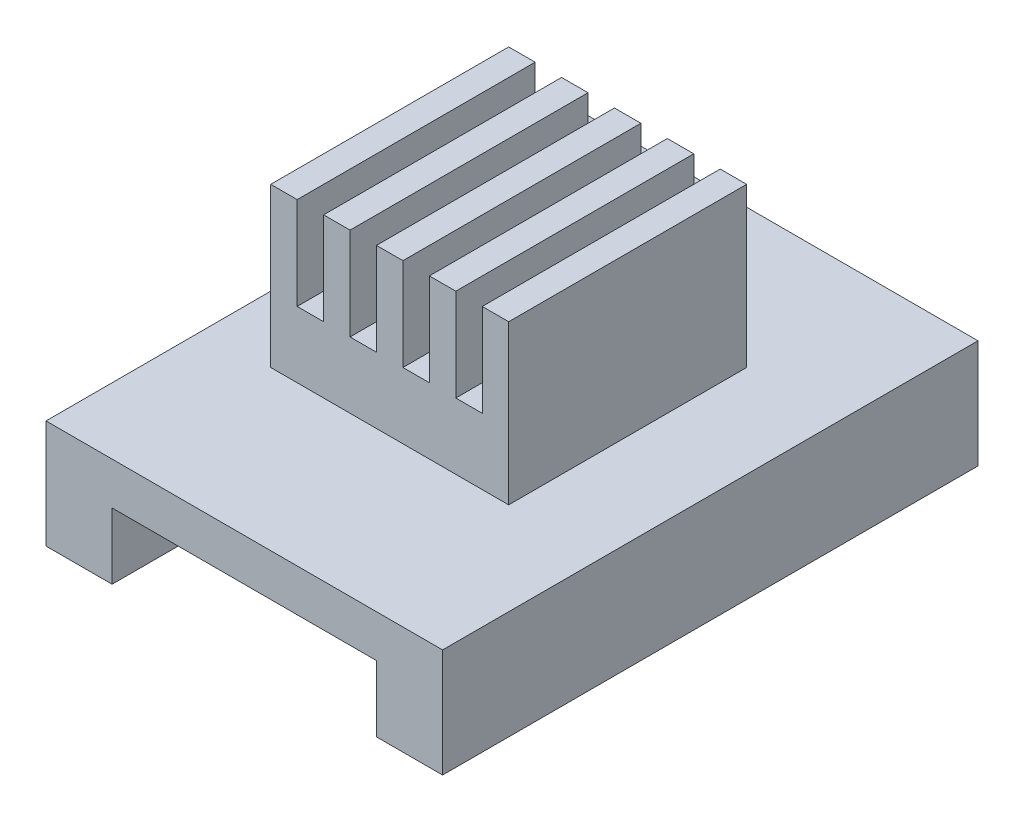
ISO-10303-21;
HEADER;
FILE_DESCRIPTION(('STEP AP214'),'2;1');
FILE_NAME('part.step','',(''),(''),'','','');
FILE_SCHEMA(('AUTOMOTIVE_DESIGN { 1 0 10303 214 1 1 1 1 }'));
ENDSEC;
DATA;
#1=APPLICATION_CONTEXT('core data for automotive mechanical design processes');
#2=APPLICATION_PROTOCOL_DEFINITION('international standard','automotive_design',2000,#1);
#3=PRODUCT_CONTEXT('',#1,'mechanical');
#4=PRODUCT('Part','Part','',(#3));
#5=PRODUCT_RELATED_PRODUCT_CATEGORY('part','',(#4));
#6=PRODUCT_DEFINITION_FORMATION('','',#4);
#7=PRODUCT_DEFINITION_CONTEXT('part definition',#1,'design');
#8=PRODUCT_DEFINITION('design','',#6,#7);
#9=PRODUCT_DEFINITION_SHAPE('','',#8);
#10=(LENGTH_UNIT() NAMED_UNIT(*) SI_UNIT(.MILLI.,.METRE.));
#11=(NAMED_UNIT(*) PLANE_ANGLE_UNIT() SI_UNIT($,.RADIAN.));
#12=(NAMED_UNIT(*) SI_UNIT($,.STERADIAN.) SOLID_ANGLE_UNIT());
#13=UNCERTAINTY_MEASURE_WITH_UNIT(LENGTH_MEASURE(1.E-05),#10,'distance_accuracy_value','');
#14=(GEOMETRIC_REPRESENTATION_CONTEXT(3) GLOBAL_UNCERTAINTY_ASSIGNED_CONTEXT((#13)) GLOBAL_UNIT_ASSIGNED_CONTEXT((#10,
#11,#12)) REPRESENTATION_CONTEXT('',''));
#15=CARTESIAN_POINT('',(0.,0.,0.));
#16=DIRECTION('',(0.,0.,1.));
#17=DIRECTION('',(1.,0.,0.));
#18=AXIS2_PLACEMENT_3D('',#15,#16,#17);
#19=CARTESIAN_POINT('',(0.,7.6,0.));
#20=DIRECTION('',(0.,-1.,0.));
#21=DIRECTION('',(0.,0.,-1.));
#22=AXIS2_PLACEMENT_3D('',#19,#20,#21);
#23=PLANE('',#22);
#24=DIRECTION('',(1.,0.,0.));
#25=VECTOR('',#24,1.);
#26=CARTESIAN_POINT('',(2.5,7.6,-6.));
#27=LINE('',#26,#25);
#28=CARTESIAN_POINT('',(2.5,7.6,-6.));
#29=VERTEX_POINT('',#28);
#30=CARTESIAN_POINT('',(3.5,7.6,-6.));
#31=VERTEX_POINT('',#30);
#32=EDGE_CURVE('E333',#29,#31,#27,.T.);
#33=ORIENTED_EDGE('',*,*,#32,.T.);
#34=DIRECTION('',(0.,0.,1.));
#35=VECTOR('',#34,1.);
#36=CARTESIAN_POINT('',(3.5,7.6,-20.251));
#37=LINE('',#36,#35);
#38=CARTESIAN_POINT('',(3.5,7.6,-15.));
#39=VERTEX_POINT('',#38);
#40=EDGE_CURVE('E238',#39,#31,#37,.T.);
#41=ORIENTED_EDGE('',*,*,#40,.F.);
#42=DIRECTION('',(-1.,0.,0.));
#43=VECTOR('',#42,1.);
#44=CARTESIAN_POINT('',(2.49999999999999,7.6,-15.));
#45=LINE('',#44,#43);
#46=CARTESIAN_POINT('',(2.49999999999999,7.6,-15.));
#47=VERTEX_POINT('',#46);
#48=EDGE_CURVE('E243',#39,#47,#45,.T.);
#49=ORIENTED_EDGE('',*,*,#48,.T.);
#50=DIRECTION('',(0.,0.,1.));
#51=VECTOR('',#50,1.);
#52=CARTESIAN_POINT('',(2.5,7.6,-6.));
#53=LINE('',#52,#51);
#54=EDGE_CURVE('E328',#47,#29,#53,.T.);
#55=ORIENTED_EDGE('',*,*,#54,.T.);
#56=EDGE_LOOP('',(#33,#41,#49,#55));
#57=FACE_BOUND('',#56,.T.);
#58=ADVANCED_FACE('F34',(#57),#23,.F.);
#59=CARTESIAN_POINT('',(5.5,7.6,-15.));
#60=VERTEX_POINT('',#59);
#61=CARTESIAN_POINT('',(4.5,7.6,-15.));
#62=VERTEX_POINT('',#61);
#63=EDGE_CURVE('E509',#60,#62,#45,.T.);
#64=ORIENTED_EDGE('',*,*,#63,.T.);
#65=DIRECTION('',(0.,0.,1.));
#66=VECTOR('',#65,1.);
#67=CARTESIAN_POINT('',(4.5,7.6,-20.251));
#68=LINE('',#67,#66);
#69=CARTESIAN_POINT('',(4.5,7.6,-6.));
#70=VERTEX_POINT('',#69);
#71=EDGE_CURVE('E254',#62,#70,#68,.T.);
#72=ORIENTED_EDGE('',*,*,#71,.T.);
#73=CARTESIAN_POINT('',(5.5,7.6,-6.));
#74=VERTEX_POINT('',#73);
#75=EDGE_CURVE('E337',#70,#74,#27,.T.);
#76=ORIENTED_EDGE('',*,*,#75,.T.);
#77=DIRECTION('',(0.,0.,1.));
#78=VECTOR('',#77,1.);
#79=CARTESIAN_POINT('',(5.5,7.6,-20.251));
#80=LINE('',#79,#78);
#81=EDGE_CURVE('E273',#60,#74,#80,.T.);
#82=ORIENTED_EDGE('',*,*,#81,.F.);
#83=EDGE_LOOP('',(#64,#72,#76,#82));
#84=FACE_BOUND('',#83,.T.);
#85=ADVANCED_FACE('F470',(#84),#23,.F.);
#86=CARTESIAN_POINT('',(7.5,7.6,-15.));
#87=VERTEX_POINT('',#86);
#88=CARTESIAN_POINT('',(6.5,7.6,-15.));
#89=VERTEX_POINT('',#88);
#90=EDGE_CURVE('E507',#87,#89,#45,.T.);
#91=ORIENTED_EDGE('',*,*,#90,.T.);
#92=DIRECTION('',(0.,0.,1.));
#93=VECTOR('',#92,1.);
#94=CARTESIAN_POINT('',(6.5,7.6,-20.251));
#95=LINE('',#94,#93);
#96=CARTESIAN_POINT('',(6.5,7.6,-6.));
#97=VERTEX_POINT('',#96);
#98=EDGE_CURVE('E275',#89,#97,#95,.T.);
#99=ORIENTED_EDGE('',*,*,#98,.T.);
#100=CARTESIAN_POINT('',(7.5,7.6,-6.));
#101=VERTEX_POINT('',#100);
#102=EDGE_CURVE('E527',#97,#101,#27,.T.);
#103=ORIENTED_EDGE('',*,*,#102,.T.);
#104=DIRECTION('',(0.,0.,1.));
#105=VECTOR('',#104,1.);
#106=CARTESIAN_POINT('',(7.5,7.6,-20.251));
#107=LINE('',#106,#105);
#108=EDGE_CURVE('E297',#87,#101,#107,.T.);
#109=ORIENTED_EDGE('',*,*,#108,.F.);
#110=EDGE_LOOP('',(#91,#99,#103,#109));
#111=FACE_BOUND('',#110,.T.);
#112=ADVANCED_FACE('F477',(#111),#23,.F.);
#113=CARTESIAN_POINT('',(9.49999999999999,7.6,-15.));
#114=VERTEX_POINT('',#113);
#115=CARTESIAN_POINT('',(8.49999999999999,7.6,-15.));
#116=VERTEX_POINT('',#115);
#117=EDGE_CURVE('E343',#114,#116,#45,.T.);
#118=ORIENTED_EDGE('',*,*,#117,.T.);
#119=DIRECTION('',(0.,0.,1.));
#120=VECTOR('',#119,1.);
#121=CARTESIAN_POINT('',(8.49999999999999,7.6,-20.251));
#122=LINE('',#121,#120);
#123=CARTESIAN_POINT('',(8.49999999999999,7.6,-6.));
#124=VERTEX_POINT('',#123);
#125=EDGE_CURVE('E299',#116,#124,#122,.T.);
#126=ORIENTED_EDGE('',*,*,#125,.T.);
#127=CARTESIAN_POINT('',(9.49999999999999,7.6,-6.));
#128=VERTEX_POINT('',#127);
#129=EDGE_CURVE('E529',#124,#128,#27,.T.);
#130=ORIENTED_EDGE('',*,*,#129,.T.);
#131=DIRECTION('',(0.,0.,1.));
#132=VECTOR('',#131,1.);
#133=CARTESIAN_POINT('',(9.49999999999999,7.6,-20.251));
#134=LINE('',#133,#132);
#135=EDGE_CURVE('E319',#114,#128,#134,.T.);
#136=ORIENTED_EDGE('',*,*,#135,.F.);
#137=EDGE_LOOP('',(#118,#126,#130,#136));
#138=FACE_BOUND('',#137,.T.);
#139=ADVANCED_FACE('F484',(#138),#23,.F.);
#140=CARTESIAN_POINT('',(0.,1.6,0.));
#141=DIRECTION('',(0.,-1.,0.));
#142=DIRECTION('',(0.,0.,-1.));
#143=AXIS2_PLACEMENT_3D('',#140,#141,#142);
#144=PLANE('',#143);
#145=DIRECTION('',(0.,0.,1.));
#146=VECTOR('',#145,1.);
#147=CARTESIAN_POINT('',(0.,1.6,0.));
#148=LINE('',#147,#146);
#149=CARTESIAN_POINT('',(0.,1.6,-20.25));
#150=VERTEX_POINT('',#149);
#151=CARTESIAN_POINT('',(0.,1.6,0.));
#152=VERTEX_POINT('',#151);
#153=EDGE_CURVE('E402',#150,#152,#148,.T.);
#154=ORIENTED_EDGE('',*,*,#153,.T.);
#155=DIRECTION('',(1.,0.,0.));
#156=VECTOR('',#155,1.);
#157=CARTESIAN_POINT('',(0.,1.6,0.));
#158=LINE('',#157,#156);
#159=CARTESIAN_POINT('',(15.,1.6,0.));
#160=VERTEX_POINT('',#159);
#161=EDGE_CURVE('E405',#152,#160,#158,.T.);
#162=ORIENTED_EDGE('',*,*,#161,.T.);
#163=DIRECTION('',(0.,0.,-1.));
#164=VECTOR('',#163,1.);
#165=CARTESIAN_POINT('',(15.,1.6,0.));
#166=LINE('',#165,#164);
#167=CARTESIAN_POINT('',(15.,1.6,-20.25));
#168=VERTEX_POINT('',#167);
#169=EDGE_CURVE('E408',#160,#168,#166,.T.);
#170=ORIENTED_EDGE('',*,*,#169,.T.);
#171=DIRECTION('',(-1.,0.,0.));
#172=VECTOR('',#171,1.);
#173=CARTESIAN_POINT('',(0.,1.6,-20.25));
#174=LINE('',#173,#172);
#175=EDGE_CURVE('E410',#168,#150,#174,.T.);
#176=ORIENTED_EDGE('',*,*,#175,.T.);
#177=EDGE_LOOP('',(#154,#162,#170,#176));
#178=FACE_BOUND('',#177,.T.);
#179=DIRECTION('',(0.,0.,1.));
#180=VECTOR('',#179,1.);
#181=CARTESIAN_POINT('',(2.5,1.6,-6.));
#182=LINE('',#181,#180);
#183=CARTESIAN_POINT('',(2.49999999999999,1.6,-15.));
#184=VERTEX_POINT('',#183);
#185=CARTESIAN_POINT('',(2.5,1.6,-6.));
#186=VERTEX_POINT('',#185);
#187=EDGE_CURVE('E237',#184,#186,#182,.T.);
#188=ORIENTED_EDGE('',*,*,#187,.F.);
#189=DIRECTION('',(-1.,0.,0.));
#190=VECTOR('',#189,1.);
#191=CARTESIAN_POINT('',(2.49999999999999,1.6,-15.));
#192=LINE('',#191,#190);
#193=CARTESIAN_POINT('',(11.5,1.6,-15.));
#194=VERTEX_POINT('',#193);
#195=EDGE_CURVE('E332',#194,#184,#192,.T.);
#196=ORIENTED_EDGE('',*,*,#195,.F.);
#197=DIRECTION('',(0.,0.,-1.));
#198=VECTOR('',#197,1.);
#199=CARTESIAN_POINT('',(11.5,1.6,-6.));
#200=LINE('',#199,#198);
#201=CARTESIAN_POINT('',(11.5,1.6,-6.));
#202=VERTEX_POINT('',#201);
#203=EDGE_CURVE('E349',#202,#194,#200,.T.);
#204=ORIENTED_EDGE('',*,*,#203,.F.);
#205=DIRECTION('',(1.,0.,0.));
#206=VECTOR('',#205,1.);
#207=CARTESIAN_POINT('',(2.5,1.6,-6.));
#208=LINE('',#207,#206);
#209=EDGE_CURVE('E346',#186,#202,#208,.T.);
#210=ORIENTED_EDGE('',*,*,#209,.F.);
#211=EDGE_LOOP('',(#188,#196,#204,#210));
#212=FACE_BOUND('',#211,.T.);
#213=ADVANCED_FACE('F440',(#178,#212),#144,.F.);
#214=CARTESIAN_POINT('',(0.,0.,0.));
#215=DIRECTION('',(0.,-1.,0.));
#216=DIRECTION('',(0.,0.,-1.));
#217=AXIS2_PLACEMENT_3D('',#214,#215,#216);
#218=PLANE('',#217);
#219=DIRECTION('',(-1.,0.,0.));
#220=VECTOR('',#219,1.);
#221=CARTESIAN_POINT('',(0.,0.,-20.25));
#222=LINE('',#221,#220);
#223=CARTESIAN_POINT('',(12.5,0.,-20.25));
#224=VERTEX_POINT('',#223);
#225=CARTESIAN_POINT('',(2.5,0.,-20.25));
#226=VERTEX_POINT('',#225);
#227=EDGE_CURVE('E406',#224,#226,#222,.T.);
#228=ORIENTED_EDGE('',*,*,#227,.F.);
#229=DIRECTION('',(0.,0.,-1.));
#230=VECTOR('',#229,1.);
#231=CARTESIAN_POINT('',(12.5,0.,0.));
#232=LINE('',#231,#230);
#233=CARTESIAN_POINT('',(12.5,0.,0.));
#234=VERTEX_POINT('',#233);
#235=EDGE_CURVE('E365',#234,#224,#232,.T.);
#236=ORIENTED_EDGE('',*,*,#235,.F.);
#237=DIRECTION('',(1.,0.,0.));
#238=VECTOR('',#237,1.);
#239=CARTESIAN_POINT('',(0.,0.,0.));
#240=LINE('',#239,#238);
#241=CARTESIAN_POINT('',(2.5,0.,0.));
#242=VERTEX_POINT('',#241);
#243=EDGE_CURVE('E401',#242,#234,#240,.T.);
#244=ORIENTED_EDGE('',*,*,#243,.F.);
#245=DIRECTION('',(0.,0.,1.));
#246=VECTOR('',#245,1.);
#247=CARTESIAN_POINT('',(2.5,0.,0.));
#248=LINE('',#247,#246);
#249=EDGE_CURVE('E382',#226,#242,#248,.T.);
#250=ORIENTED_EDGE('',*,*,#249,.F.);
#251=EDGE_LOOP('',(#228,#236,#244,#250));
#252=FACE_BOUND('',#251,.T.);
#253=ADVANCED_FACE('F457',(#252),#218,.T.);
#254=CARTESIAN_POINT('',(0.,1.6,0.));
#255=DIRECTION('',(1.,0.,0.));
#256=DIRECTION('',(0.,0.,-1.));
#257=AXIS2_PLACEMENT_3D('',#254,#255,#256);
#258=PLANE('',#257);
#259=DIRECTION('',(0.,-1.,0.));
#260=VECTOR('',#259,1.);
#261=CARTESIAN_POINT('',(0.,1.6,-20.25));
#262=LINE('',#261,#260);
#263=CARTESIAN_POINT('',(0.,-2.5,-20.25));
#264=VERTEX_POINT('',#263);
#265=EDGE_CURVE('E412',#150,#264,#262,.T.);
#266=ORIENTED_EDGE('',*,*,#265,.T.);
#267=DIRECTION('',(0.,0.,-1.));
#268=VECTOR('',#267,1.);
#269=CARTESIAN_POINT('',(0.,-2.5,0.));
#270=LINE('',#269,#268);
#271=CARTESIAN_POINT('',(0.,-2.5,0.));
#272=VERTEX_POINT('',#271);
#273=EDGE_CURVE('E383',#272,#264,#270,.T.);
#274=ORIENTED_EDGE('',*,*,#273,.F.);
#275=DIRECTION('',(0.,-1.,0.));
#276=VECTOR('',#275,1.);
#277=CARTESIAN_POINT('',(0.,1.6,0.));
#278=LINE('',#277,#276);
#279=EDGE_CURVE('E11',#152,#272,#278,.T.);
#280=ORIENTED_EDGE('',*,*,#279,.F.);
#281=ORIENTED_EDGE('',*,*,#153,.F.);
#282=EDGE_LOOP('',(#266,#274,#280,#281));
#283=FACE_BOUND('',#282,.T.);
#284=ADVANCED_FACE('F36',(#283),#258,.F.);
#285=CARTESIAN_POINT('',(0.,1.6,0.));
#286=DIRECTION('',(0.,0.,-1.));
#287=DIRECTION('',(-1.,0.,0.));
#288=AXIS2_PLACEMENT_3D('',#285,#286,#287);
#289=PLANE('',#288);
#290=ORIENTED_EDGE('',*,*,#279,.T.);
#291=DIRECTION('',(-1.,0.,0.));
#292=VECTOR('',#291,1.);
#293=CARTESIAN_POINT('',(0.,-2.5,0.));
#294=LINE('',#293,#292);
#295=CARTESIAN_POINT('',(2.5,-2.5,0.));
#296=VERTEX_POINT('',#295);
#297=EDGE_CURVE('E390',#296,#272,#294,.T.);
#298=ORIENTED_EDGE('',*,*,#297,.F.);
#299=DIRECTION('',(0.,1.,0.));
#300=VECTOR('',#299,1.);
#301=CARTESIAN_POINT('',(2.5,-2.5,0.));
#302=LINE('',#301,#300);
#303=EDGE_CURVE('E393',#296,#242,#302,.T.);
#304=ORIENTED_EDGE('',*,*,#303,.T.);
#305=ORIENTED_EDGE('',*,*,#243,.T.);
#306=DIRECTION('',(0.,1.,0.));
#307=VECTOR('',#306,1.);
#308=CARTESIAN_POINT('',(12.5,-2.5,0.));
#309=LINE('',#308,#307);
#310=CARTESIAN_POINT('',(12.5,-2.5,0.));
#311=VERTEX_POINT('',#310);
#312=EDGE_CURVE('E380',#311,#234,#309,.T.);
#313=ORIENTED_EDGE('',*,*,#312,.F.);
#314=DIRECTION('',(-1.,0.,0.));
#315=VECTOR('',#314,1.);
#316=CARTESIAN_POINT('',(15.,-2.5,0.));
#317=LINE('',#316,#315);
#318=CARTESIAN_POINT('',(15.,-2.5,0.));
#319=VERTEX_POINT('',#318);
#320=EDGE_CURVE('E369',#319,#311,#317,.T.);
#321=ORIENTED_EDGE('',*,*,#320,.F.);
#322=DIRECTION('',(0.,-1.,0.));
#323=VECTOR('',#322,1.);
#324=CARTESIAN_POINT('',(15.,1.6,0.));
#325=LINE('',#324,#323);
#326=EDGE_CURVE('E42',#160,#319,#325,.T.);
#327=ORIENTED_EDGE('',*,*,#326,.F.);
#328=ORIENTED_EDGE('',*,*,#161,.F.);
#329=EDGE_LOOP('',(#290,#298,#304,#305,#313,#321,#327,#328));
#330=FACE_BOUND('',#329,.T.);
#331=ADVANCED_FACE('F427',(#330),#289,.F.);
#332=CARTESIAN_POINT('',(15.,1.6,0.));
#333=DIRECTION('',(-1.,0.,0.));
#334=DIRECTION('',(0.,0.,1.));
#335=AXIS2_PLACEMENT_3D('',#332,#333,#334);
#336=PLANE('',#335);
#337=ORIENTED_EDGE('',*,*,#326,.T.);
#338=DIRECTION('',(0.,0.,1.));
#339=VECTOR('',#338,1.);
#340=CARTESIAN_POINT('',(15.,-2.5,0.));
#341=LINE('',#340,#339);
#342=CARTESIAN_POINT('',(15.,-2.5,-20.25));
#343=VERTEX_POINT('',#342);
#344=EDGE_CURVE('E366',#343,#319,#341,.T.);
#345=ORIENTED_EDGE('',*,*,#344,.F.);
#346=DIRECTION('',(0.,-1.,0.));
#347=VECTOR('',#346,1.);
#348=CARTESIAN_POINT('',(15.,1.6,-20.25));
#349=LINE('',#348,#347);
#350=EDGE_CURVE('E417',#168,#343,#349,.T.);
#351=ORIENTED_EDGE('',*,*,#350,.F.);
#352=ORIENTED_EDGE('',*,*,#169,.F.);
#353=EDGE_LOOP('',(#337,#345,#351,#352));
#354=FACE_BOUND('',#353,.T.);
#355=ADVANCED_FACE('F423',(#354),#336,.F.);
#356=CARTESIAN_POINT('',(0.,1.6,-20.25));
#357=DIRECTION('',(0.,0.,1.));
#358=DIRECTION('',(1.,0.,0.));
#359=AXIS2_PLACEMENT_3D('',#356,#357,#358);
#360=PLANE('',#359);
#361=ORIENTED_EDGE('',*,*,#350,.T.);
#362=DIRECTION('',(1.,0.,0.));
#363=VECTOR('',#362,1.);
#364=CARTESIAN_POINT('',(15.,-2.5,-20.25));
#365=LINE('',#364,#363);
#366=CARTESIAN_POINT('',(12.5,-2.5,-20.25));
#367=VERTEX_POINT('',#366);
#368=EDGE_CURVE('E373',#367,#343,#365,.T.);
#369=ORIENTED_EDGE('',*,*,#368,.F.);
#370=DIRECTION('',(0.,1.,0.));
#371=VECTOR('',#370,1.);
#372=CARTESIAN_POINT('',(12.5,-2.5,-20.25));
#373=LINE('',#372,#371);
#374=EDGE_CURVE('E376',#367,#224,#373,.T.);
#375=ORIENTED_EDGE('',*,*,#374,.T.);
#376=ORIENTED_EDGE('',*,*,#227,.T.);
#377=DIRECTION('',(0.,1.,0.));
#378=VECTOR('',#377,1.);
#379=CARTESIAN_POINT('',(2.5,-2.5,-20.25));
#380=LINE('',#379,#378);
#381=CARTESIAN_POINT('',(2.5,-2.5,-20.25));
#382=VERTEX_POINT('',#381);
#383=EDGE_CURVE('E398',#382,#226,#380,.T.);
#384=ORIENTED_EDGE('',*,*,#383,.F.);
#385=DIRECTION('',(1.,0.,0.));
#386=VECTOR('',#385,1.);
#387=CARTESIAN_POINT('',(0.,-2.5,-20.25));
#388=LINE('',#387,#386);
#389=EDGE_CURVE('E386',#264,#382,#388,.T.);
#390=ORIENTED_EDGE('',*,*,#389,.F.);
#391=ORIENTED_EDGE('',*,*,#265,.F.);
#392=ORIENTED_EDGE('',*,*,#175,.F.);
#393=EDGE_LOOP('',(#361,#369,#375,#376,#384,#390,#391,#392));
#394=FACE_BOUND('',#393,.T.);
#395=ADVANCED_FACE('F434',(#394),#360,.F.);
#396=CARTESIAN_POINT('',(2.5,-2.5,0.));
#397=DIRECTION('',(-1.,0.,0.));
#398=DIRECTION('',(0.,0.,1.));
#399=AXIS2_PLACEMENT_3D('',#396,#397,#398);
#400=PLANE('',#399);
#401=ORIENTED_EDGE('',*,*,#249,.T.);
#402=ORIENTED_EDGE('',*,*,#303,.F.);
#403=DIRECTION('',(0.,0.,1.));
#404=VECTOR('',#403,1.);
#405=CARTESIAN_POINT('',(2.5,-2.5,0.));
#406=LINE('',#405,#404);
#407=EDGE_CURVE('E388',#382,#296,#406,.T.);
#408=ORIENTED_EDGE('',*,*,#407,.F.);
#409=ORIENTED_EDGE('',*,*,#383,.T.);
#410=EDGE_LOOP('',(#401,#402,#408,#409));
#411=FACE_BOUND('',#410,.T.);
#412=ADVANCED_FACE('F454',(#411),#400,.F.);
#413=CARTESIAN_POINT('',(0.,-2.5,0.));
#414=DIRECTION('',(0.,-1.,0.));
#415=DIRECTION('',(0.,0.,-1.));
#416=AXIS2_PLACEMENT_3D('',#413,#414,#415);
#417=PLANE('',#416);
#418=ORIENTED_EDGE('',*,*,#273,.T.);
#419=ORIENTED_EDGE('',*,*,#389,.T.);
#420=ORIENTED_EDGE('',*,*,#407,.T.);
#421=ORIENTED_EDGE('',*,*,#297,.T.);
#422=EDGE_LOOP('',(#418,#419,#420,#421));
#423=FACE_BOUND('',#422,.T.);
#424=ADVANCED_FACE('F447',(#423),#417,.T.);
#425=CARTESIAN_POINT('',(12.5,-2.5,0.));
#426=DIRECTION('',(1.,0.,0.));
#427=DIRECTION('',(0.,0.,-1.));
#428=AXIS2_PLACEMENT_3D('',#425,#426,#427);
#429=PLANE('',#428);
#430=ORIENTED_EDGE('',*,*,#235,.T.);
#431=ORIENTED_EDGE('',*,*,#374,.F.);
#432=DIRECTION('',(0.,0.,-1.));
#433=VECTOR('',#432,1.);
#434=CARTESIAN_POINT('',(12.5,-2.5,0.));
#435=LINE('',#434,#433);
#436=EDGE_CURVE('E371',#311,#367,#435,.T.);
#437=ORIENTED_EDGE('',*,*,#436,.F.);
#438=ORIENTED_EDGE('',*,*,#312,.T.);
#439=EDGE_LOOP('',(#430,#431,#437,#438));
#440=FACE_BOUND('',#439,.T.);
#441=ADVANCED_FACE('F459',(#440),#429,.F.);
#442=CARTESIAN_POINT('',(0.,-2.5,0.));
#443=DIRECTION('',(0.,1.,0.));
#444=DIRECTION('',(0.,0.,1.));
#445=AXIS2_PLACEMENT_3D('',#442,#443,#444);
#446=PLANE('',#445);
#447=ORIENTED_EDGE('',*,*,#344,.T.);
#448=ORIENTED_EDGE('',*,*,#320,.T.);
#449=ORIENTED_EDGE('',*,*,#436,.T.);
#450=ORIENTED_EDGE('',*,*,#368,.T.);
#451=EDGE_LOOP('',(#447,#448,#449,#450));
#452=FACE_BOUND('',#451,.T.);
#453=ADVANCED_FACE('F430',(#452),#446,.F.);
#454=CARTESIAN_POINT('',(2.5,7.6,-6.));
#455=DIRECTION('',(1.,0.,0.));
#456=DIRECTION('',(0.,0.,-1.));
#457=AXIS2_PLACEMENT_3D('',#454,#455,#456);
#458=PLANE('',#457);
#459=ORIENTED_EDGE('',*,*,#187,.T.);
#460=DIRECTION('',(0.,-1.,0.));
#461=VECTOR('',#460,1.);
#462=CARTESIAN_POINT('',(2.5,7.6,-6.));
#463=LINE('',#462,#461);
#464=EDGE_CURVE('E362',#29,#186,#463,.T.);
#465=ORIENTED_EDGE('',*,*,#464,.F.);
#466=ORIENTED_EDGE('',*,*,#54,.F.);
#467=DIRECTION('',(0.,-1.,0.));
#468=VECTOR('',#467,1.);
#469=CARTESIAN_POINT('',(2.49999999999999,7.6,-15.));
#470=LINE('',#469,#468);
#471=EDGE_CURVE('E342',#47,#184,#470,.T.);
#472=ORIENTED_EDGE('',*,*,#471,.T.);
#473=EDGE_LOOP('',(#459,#465,#466,#472));
#474=FACE_BOUND('',#473,.T.);
#475=ADVANCED_FACE('F466',(#474),#458,.F.);
#476=CARTESIAN_POINT('',(2.5,7.6,-6.));
#477=DIRECTION('',(0.,0.,-1.));
#478=DIRECTION('',(-1.,0.,0.));
#479=AXIS2_PLACEMENT_3D('',#476,#477,#478);
#480=PLANE('',#479);
#481=DIRECTION('',(1.,0.,0.));
#482=VECTOR('',#481,1.);
#483=CARTESIAN_POINT('',(3.5,4.1,-6.));
#484=LINE('',#483,#482);
#485=CARTESIAN_POINT('',(3.5,4.1,-6.));
#486=VERTEX_POINT('',#485);
#487=CARTESIAN_POINT('',(4.5,4.1,-6.));
#488=VERTEX_POINT('',#487);
#489=EDGE_CURVE('E246',#486,#488,#484,.T.);
#490=ORIENTED_EDGE('',*,*,#489,.F.);
#491=DIRECTION('',(0.,-1.,0.));
#492=VECTOR('',#491,1.);
#493=CARTESIAN_POINT('',(3.5,7.6,-6.));
#494=LINE('',#493,#492);
#495=EDGE_CURVE('E224',#31,#486,#494,.T.);
#496=ORIENTED_EDGE('',*,*,#495,.F.);
#497=ORIENTED_EDGE('',*,*,#32,.F.);
#498=ORIENTED_EDGE('',*,*,#464,.T.);
#499=ORIENTED_EDGE('',*,*,#209,.T.);
#500=DIRECTION('',(0.,-1.,0.));
#501=VECTOR('',#500,1.);
#502=CARTESIAN_POINT('',(11.5,7.6,-6.));
#503=LINE('',#502,#501);
#504=CARTESIAN_POINT('',(11.5,7.6,-6.));
#505=VERTEX_POINT('',#504);
#506=EDGE_CURVE('E359',#505,#202,#503,.T.);
#507=ORIENTED_EDGE('',*,*,#506,.F.);
#508=CARTESIAN_POINT('',(10.5,7.6,-6.));
#509=VERTEX_POINT('',#508);
#510=EDGE_CURVE('E331',#509,#505,#27,.T.);
#511=ORIENTED_EDGE('',*,*,#510,.F.);
#512=DIRECTION('',(0.,1.,0.));
#513=VECTOR('',#512,1.);
#514=CARTESIAN_POINT('',(10.5,7.6,-6.));
#515=LINE('',#514,#513);
#516=CARTESIAN_POINT('',(10.5,4.1,-6.));
#517=VERTEX_POINT('',#516);
#518=EDGE_CURVE('E49',#517,#509,#515,.T.);
#519=ORIENTED_EDGE('',*,*,#518,.F.);
#520=DIRECTION('',(1.,0.,0.));
#521=VECTOR('',#520,1.);
#522=CARTESIAN_POINT('',(9.49999999999999,4.1,-6.));
#523=LINE('',#522,#521);
#524=CARTESIAN_POINT('',(9.49999999999999,4.1,-6.));
#525=VERTEX_POINT('',#524);
#526=EDGE_CURVE('E314',#525,#517,#523,.T.);
#527=ORIENTED_EDGE('',*,*,#526,.F.);
#528=DIRECTION('',(0.,-1.,0.));
#529=VECTOR('',#528,1.);
#530=CARTESIAN_POINT('',(9.49999999999999,7.6,-6.));
#531=LINE('',#530,#529);
#532=EDGE_CURVE('E311',#128,#525,#531,.T.);
#533=ORIENTED_EDGE('',*,*,#532,.F.);
#534=ORIENTED_EDGE('',*,*,#129,.F.);
#535=DIRECTION('',(0.,1.,0.));
#536=VECTOR('',#535,1.);
#537=CARTESIAN_POINT('',(8.49999999999999,7.6,-6.));
#538=LINE('',#537,#536);
#539=CARTESIAN_POINT('',(8.49999999999999,4.1,-6.));
#540=VERTEX_POINT('',#539);
#541=EDGE_CURVE('E57',#540,#124,#538,.T.);
#542=ORIENTED_EDGE('',*,*,#541,.F.);
#543=DIRECTION('',(1.,0.,0.));
#544=VECTOR('',#543,1.);
#545=CARTESIAN_POINT('',(7.5,4.1,-6.));
#546=LINE('',#545,#544);
#547=CARTESIAN_POINT('',(7.5,4.1,-6.));
#548=VERTEX_POINT('',#547);
#549=EDGE_CURVE('E292',#548,#540,#546,.T.);
#550=ORIENTED_EDGE('',*,*,#549,.F.);
#551=DIRECTION('',(0.,-1.,0.));
#552=VECTOR('',#551,1.);
#553=CARTESIAN_POINT('',(7.5,7.6,-6.));
#554=LINE('',#553,#552);
#555=EDGE_CURVE('E289',#101,#548,#554,.T.);
#556=ORIENTED_EDGE('',*,*,#555,.F.);
#557=ORIENTED_EDGE('',*,*,#102,.F.);
#558=DIRECTION('',(0.,1.,0.));
#559=VECTOR('',#558,1.);
#560=CARTESIAN_POINT('',(6.5,7.6,-6.));
#561=LINE('',#560,#559);
#562=CARTESIAN_POINT('',(6.5,4.1,-6.));
#563=VERTEX_POINT('',#562);
#564=EDGE_CURVE('E270',#563,#97,#561,.T.);
#565=ORIENTED_EDGE('',*,*,#564,.F.);
#566=DIRECTION('',(1.,0.,0.));
#567=VECTOR('',#566,1.);
#568=CARTESIAN_POINT('',(5.5,4.1,-6.));
#569=LINE('',#568,#567);
#570=CARTESIAN_POINT('',(5.5,4.1,-6.));
#571=VERTEX_POINT('',#570);
#572=EDGE_CURVE('E267',#571,#563,#569,.T.);
#573=ORIENTED_EDGE('',*,*,#572,.F.);
#574=DIRECTION('',(0.,-1.,0.));
#575=VECTOR('',#574,1.);
#576=CARTESIAN_POINT('',(5.5,7.6,-6.));
#577=LINE('',#576,#575);
#578=EDGE_CURVE('E264',#74,#571,#577,.T.);
#579=ORIENTED_EDGE('',*,*,#578,.F.);
#580=ORIENTED_EDGE('',*,*,#75,.F.);
#581=DIRECTION('',(0.,1.,0.));
#582=VECTOR('',#581,1.);
#583=CARTESIAN_POINT('',(4.5,7.6,-6.));
#584=LINE('',#583,#582);
#585=EDGE_CURVE('E229',#488,#70,#584,.T.);
#586=ORIENTED_EDGE('',*,*,#585,.F.);
#587=EDGE_LOOP('',(#490,#496,#497,#498,#499,#507,#511,#519,#527,#533,#534,#542,#550,#556,#557,
#565,#573,#579,#580,#586));
#588=FACE_BOUND('',#587,.T.);
#589=ADVANCED_FACE('F519',(#588),#480,.F.);
#590=CARTESIAN_POINT('',(11.5,7.6,-6.));
#591=DIRECTION('',(-1.,0.,0.));
#592=DIRECTION('',(0.,0.,1.));
#593=AXIS2_PLACEMENT_3D('',#590,#591,#592);
#594=PLANE('',#593);
#595=ORIENTED_EDGE('',*,*,#203,.T.);
#596=DIRECTION('',(0.,-1.,0.));
#597=VECTOR('',#596,1.);
#598=CARTESIAN_POINT('',(11.5,7.6,-15.));
#599=LINE('',#598,#597);
#600=CARTESIAN_POINT('',(11.5,7.6,-15.));
#601=VERTEX_POINT('',#600);
#602=EDGE_CURVE('E356',#601,#194,#599,.T.);
#603=ORIENTED_EDGE('',*,*,#602,.F.);
#604=DIRECTION('',(0.,0.,-1.));
#605=VECTOR('',#604,1.);
#606=CARTESIAN_POINT('',(11.5,7.6,-6.));
#607=LINE('',#606,#605);
#608=EDGE_CURVE('E336',#505,#601,#607,.T.);
#609=ORIENTED_EDGE('',*,*,#608,.F.);
#610=ORIENTED_EDGE('',*,*,#506,.T.);
#611=EDGE_LOOP('',(#595,#603,#609,#610));
#612=FACE_BOUND('',#611,.T.);
#613=ADVANCED_FACE('F491',(#612),#594,.F.);
#614=CARTESIAN_POINT('',(2.49999999999999,7.6,-15.));
#615=DIRECTION('',(0.,0.,1.));
#616=DIRECTION('',(1.,0.,0.));
#617=AXIS2_PLACEMENT_3D('',#614,#615,#616);
#618=PLANE('',#617);
#619=ORIENTED_EDGE('',*,*,#48,.F.);
#620=DIRECTION('',(0.,1.,0.));
#621=VECTOR('',#620,1.);
#622=CARTESIAN_POINT('',(3.5,7.6,-15.));
#623=LINE('',#622,#621);
#624=CARTESIAN_POINT('',(3.5,4.1,-15.));
#625=VERTEX_POINT('',#624);
#626=EDGE_CURVE('E221',#625,#39,#623,.T.);
#627=ORIENTED_EDGE('',*,*,#626,.F.);
#628=DIRECTION('',(-1.,0.,0.));
#629=VECTOR('',#628,1.);
#630=CARTESIAN_POINT('',(3.5,4.1,-15.));
#631=LINE('',#630,#629);
#632=CARTESIAN_POINT('',(4.5,4.1,-15.));
#633=VERTEX_POINT('',#632);
#634=EDGE_CURVE('E232',#633,#625,#631,.T.);
#635=ORIENTED_EDGE('',*,*,#634,.F.);
#636=DIRECTION('',(0.,-1.,0.));
#637=VECTOR('',#636,1.);
#638=CARTESIAN_POINT('',(4.5,7.6,-15.));
#639=LINE('',#638,#637);
#640=EDGE_CURVE('E244',#62,#633,#639,.T.);
#641=ORIENTED_EDGE('',*,*,#640,.F.);
#642=ORIENTED_EDGE('',*,*,#63,.F.);
#643=DIRECTION('',(0.,1.,0.));
#644=VECTOR('',#643,1.);
#645=CARTESIAN_POINT('',(5.5,7.6,-15.));
#646=LINE('',#645,#644);
#647=CARTESIAN_POINT('',(5.5,4.1,-15.));
#648=VERTEX_POINT('',#647);
#649=EDGE_CURVE('E261',#648,#60,#646,.T.);
#650=ORIENTED_EDGE('',*,*,#649,.F.);
#651=DIRECTION('',(-1.,0.,0.));
#652=VECTOR('',#651,1.);
#653=CARTESIAN_POINT('',(5.5,4.1,-15.));
#654=LINE('',#653,#652);
#655=CARTESIAN_POINT('',(6.5,4.1,-15.));
#656=VERTEX_POINT('',#655);
#657=EDGE_CURVE('E248',#656,#648,#654,.T.);
#658=ORIENTED_EDGE('',*,*,#657,.F.);
#659=DIRECTION('',(0.,-1.,0.));
#660=VECTOR('',#659,1.);
#661=CARTESIAN_POINT('',(6.5,7.6,-15.));
#662=LINE('',#661,#660);
#663=EDGE_CURVE('E258',#89,#656,#662,.T.);
#664=ORIENTED_EDGE('',*,*,#663,.F.);
#665=ORIENTED_EDGE('',*,*,#90,.F.);
#666=DIRECTION('',(0.,1.,0.));
#667=VECTOR('',#666,1.);
#668=CARTESIAN_POINT('',(7.5,7.6,-15.));
#669=LINE('',#668,#667);
#670=CARTESIAN_POINT('',(7.5,4.1,-15.));
#671=VERTEX_POINT('',#670);
#672=EDGE_CURVE('E286',#671,#87,#669,.T.);
#673=ORIENTED_EDGE('',*,*,#672,.F.);
#674=DIRECTION('',(-1.,0.,0.));
#675=VECTOR('',#674,1.);
#676=CARTESIAN_POINT('',(7.5,4.1,-15.));
#677=LINE('',#676,#675);
#678=CARTESIAN_POINT('',(8.49999999999999,4.1,-15.));
#679=VERTEX_POINT('',#678);
#680=EDGE_CURVE('E262',#679,#671,#677,.T.);
#681=ORIENTED_EDGE('',*,*,#680,.F.);
#682=DIRECTION('',(0.,-1.,0.));
#683=VECTOR('',#682,1.);
#684=CARTESIAN_POINT('',(8.49999999999999,7.6,-15.));
#685=LINE('',#684,#683);
#686=EDGE_CURVE('E283',#116,#679,#685,.T.);
#687=ORIENTED_EDGE('',*,*,#686,.F.);
#688=ORIENTED_EDGE('',*,*,#117,.F.);
#689=DIRECTION('',(0.,1.,0.));
#690=VECTOR('',#689,1.);
#691=CARTESIAN_POINT('',(9.49999999999999,7.6,-15.));
#692=LINE('',#691,#690);
#693=CARTESIAN_POINT('',(9.49999999999999,4.1,-15.));
#694=VERTEX_POINT('',#693);
#695=EDGE_CURVE('E309',#694,#114,#692,.T.);
#696=ORIENTED_EDGE('',*,*,#695,.F.);
#697=DIRECTION('',(-1.,0.,0.));
#698=VECTOR('',#697,1.);
#699=CARTESIAN_POINT('',(9.49999999999999,4.1,-15.));
#700=LINE('',#699,#698);
#701=CARTESIAN_POINT('',(10.5,4.1,-15.));
#702=VERTEX_POINT('',#701);
#703=EDGE_CURVE('E287',#702,#694,#700,.T.);
#704=ORIENTED_EDGE('',*,*,#703,.F.);
#705=DIRECTION('',(0.,-1.,0.));
#706=VECTOR('',#705,1.);
#707=CARTESIAN_POINT('',(10.5,7.6,-15.));
#708=LINE('',#707,#706);
#709=CARTESIAN_POINT('',(10.5,7.6,-15.));
#710=VERTEX_POINT('',#709);
#711=EDGE_CURVE('E306',#710,#702,#708,.T.);
#712=ORIENTED_EDGE('',*,*,#711,.F.);
#713=EDGE_CURVE('E339',#601,#710,#45,.T.);
#714=ORIENTED_EDGE('',*,*,#713,.F.);
#715=ORIENTED_EDGE('',*,*,#602,.T.);
#716=ORIENTED_EDGE('',*,*,#195,.T.);
#717=ORIENTED_EDGE('',*,*,#471,.F.);
#718=EDGE_LOOP('',(#619,#627,#635,#641,#642,#650,#658,#664,#665,#673,#681,#687,#688,#696,#704,
#712,#714,#715,#716,#717));
#719=FACE_BOUND('',#718,.T.);
#720=ADVANCED_FACE('F241',(#719),#618,.F.);
#721=ORIENTED_EDGE('',*,*,#713,.T.);
#722=DIRECTION('',(0.,0.,1.));
#723=VECTOR('',#722,1.);
#724=CARTESIAN_POINT('',(10.5,7.6,-20.251));
#725=LINE('',#724,#723);
#726=EDGE_CURVE('E321',#710,#509,#725,.T.);
#727=ORIENTED_EDGE('',*,*,#726,.T.);
#728=ORIENTED_EDGE('',*,*,#510,.T.);
#729=ORIENTED_EDGE('',*,*,#608,.T.);
#730=EDGE_LOOP('',(#721,#727,#728,#729));
#731=FACE_BOUND('',#730,.T.);
#732=ADVANCED_FACE('F473',(#731),#23,.F.);
#733=CARTESIAN_POINT('',(9.49999999999999,7.6,-20.251));
#734=DIRECTION('',(-1.,0.,0.));
#735=DIRECTION('',(0.,-1.,0.));
#736=AXIS2_PLACEMENT_3D('',#733,#734,#735);
#737=PLANE('',#736);
#738=ORIENTED_EDGE('',*,*,#695,.T.);
#739=ORIENTED_EDGE('',*,*,#135,.T.);
#740=ORIENTED_EDGE('',*,*,#532,.T.);
#741=DIRECTION('',(0.,0.,1.));
#742=VECTOR('',#741,1.);
#743=CARTESIAN_POINT('',(9.49999999999999,4.1,-20.251));
#744=LINE('',#743,#742);
#745=EDGE_CURVE('E318',#694,#525,#744,.T.);
#746=ORIENTED_EDGE('',*,*,#745,.F.);
#747=EDGE_LOOP('',(#738,#739,#740,#746));
#748=FACE_BOUND('',#747,.T.);
#749=ADVANCED_FACE('F482',(#748),#737,.F.);
#750=CARTESIAN_POINT('',(10.5,7.6,-20.251));
#751=DIRECTION('',(1.,0.,0.));
#752=DIRECTION('',(0.,1.,0.));
#753=AXIS2_PLACEMENT_3D('',#750,#751,#752);
#754=PLANE('',#753);
#755=ORIENTED_EDGE('',*,*,#711,.T.);
#756=DIRECTION('',(0.,0.,1.));
#757=VECTOR('',#756,1.);
#758=CARTESIAN_POINT('',(10.5,4.1,-20.251));
#759=LINE('',#758,#757);
#760=EDGE_CURVE('E323',#702,#517,#759,.T.);
#761=ORIENTED_EDGE('',*,*,#760,.T.);
#762=ORIENTED_EDGE('',*,*,#518,.T.);
#763=ORIENTED_EDGE('',*,*,#726,.F.);
#764=EDGE_LOOP('',(#755,#761,#762,#763));
#765=FACE_BOUND('',#764,.T.);
#766=ADVANCED_FACE('F489',(#765),#754,.F.);
#767=CARTESIAN_POINT('',(9.49999999999999,4.1,-20.251));
#768=DIRECTION('',(0.,-1.,0.));
#769=DIRECTION('',(0.,0.,-1.));
#770=AXIS2_PLACEMENT_3D('',#767,#768,#769);
#771=PLANE('',#770);
#772=ORIENTED_EDGE('',*,*,#703,.T.);
#773=ORIENTED_EDGE('',*,*,#745,.T.);
#774=ORIENTED_EDGE('',*,*,#526,.T.);
#775=ORIENTED_EDGE('',*,*,#760,.F.);
#776=EDGE_LOOP('',(#772,#773,#774,#775));
#777=FACE_BOUND('',#776,.T.);
#778=ADVANCED_FACE('F540',(#777),#771,.F.);
#779=CARTESIAN_POINT('',(7.5,7.6,-20.251));
#780=DIRECTION('',(-1.,0.,0.));
#781=DIRECTION('',(0.,-1.,0.));
#782=AXIS2_PLACEMENT_3D('',#779,#780,#781);
#783=PLANE('',#782);
#784=ORIENTED_EDGE('',*,*,#672,.T.);
#785=ORIENTED_EDGE('',*,*,#108,.T.);
#786=ORIENTED_EDGE('',*,*,#555,.T.);
#787=DIRECTION('',(0.,0.,1.));
#788=VECTOR('',#787,1.);
#789=CARTESIAN_POINT('',(7.5,4.1,-20.251));
#790=LINE('',#789,#788);
#791=EDGE_CURVE('E296',#671,#548,#790,.T.);
#792=ORIENTED_EDGE('',*,*,#791,.F.);
#793=EDGE_LOOP('',(#784,#785,#786,#792));
#794=FACE_BOUND('',#793,.T.);
#795=ADVANCED_FACE('F549',(#794),#783,.F.);
#796=CARTESIAN_POINT('',(8.49999999999999,7.6,-20.251));
#797=DIRECTION('',(1.,0.,0.));
#798=DIRECTION('',(0.,0.,-1.));
#799=AXIS2_PLACEMENT_3D('',#796,#797,#798);
#800=PLANE('',#799);
#801=ORIENTED_EDGE('',*,*,#686,.T.);
#802=DIRECTION('',(0.,0.,1.));
#803=VECTOR('',#802,1.);
#804=CARTESIAN_POINT('',(8.49999999999999,4.1,-20.251));
#805=LINE('',#804,#803);
#806=EDGE_CURVE('E301',#679,#540,#805,.T.);
#807=ORIENTED_EDGE('',*,*,#806,.T.);
#808=ORIENTED_EDGE('',*,*,#541,.T.);
#809=ORIENTED_EDGE('',*,*,#125,.F.);
#810=EDGE_LOOP('',(#801,#807,#808,#809));
#811=FACE_BOUND('',#810,.T.);
#812=ADVANCED_FACE('F568',(#811),#800,.F.);
#813=CARTESIAN_POINT('',(7.5,4.1,-20.251));
#814=DIRECTION('',(0.,-1.,0.));
#815=DIRECTION('',(1.,0.,0.));
#816=AXIS2_PLACEMENT_3D('',#813,#814,#815);
#817=PLANE('',#816);
#818=ORIENTED_EDGE('',*,*,#680,.T.);
#819=ORIENTED_EDGE('',*,*,#791,.T.);
#820=ORIENTED_EDGE('',*,*,#549,.T.);
#821=ORIENTED_EDGE('',*,*,#806,.F.);
#822=EDGE_LOOP('',(#818,#819,#820,#821));
#823=FACE_BOUND('',#822,.T.);
#824=ADVANCED_FACE('F545',(#823),#817,.F.);
#825=CARTESIAN_POINT('',(5.5,7.6,-20.251));
#826=DIRECTION('',(-1.,0.,0.));
#827=DIRECTION('',(0.,0.,1.));
#828=AXIS2_PLACEMENT_3D('',#825,#826,#827);
#829=PLANE('',#828);
#830=ORIENTED_EDGE('',*,*,#649,.T.);
#831=ORIENTED_EDGE('',*,*,#81,.T.);
#832=ORIENTED_EDGE('',*,*,#578,.T.);
#833=DIRECTION('',(0.,0.,1.));
#834=VECTOR('',#833,1.);
#835=CARTESIAN_POINT('',(5.5,4.1,-20.251));
#836=LINE('',#835,#834);
#837=EDGE_CURVE('E272',#648,#571,#836,.T.);
#838=ORIENTED_EDGE('',*,*,#837,.F.);
#839=EDGE_LOOP('',(#830,#831,#832,#838));
#840=FACE_BOUND('',#839,.T.);
#841=ADVANCED_FACE('F560',(#840),#829,.F.);
#842=CARTESIAN_POINT('',(6.5,7.6,-20.251));
#843=DIRECTION('',(1.,0.,0.));
#844=DIRECTION('',(0.,0.,-1.));
#845=AXIS2_PLACEMENT_3D('',#842,#843,#844);
#846=PLANE('',#845);
#847=ORIENTED_EDGE('',*,*,#663,.T.);
#848=DIRECTION('',(0.,0.,1.));
#849=VECTOR('',#848,1.);
#850=CARTESIAN_POINT('',(6.5,4.1,-20.251));
#851=LINE('',#850,#849);
#852=EDGE_CURVE('E278',#656,#563,#851,.T.);
#853=ORIENTED_EDGE('',*,*,#852,.T.);
#854=ORIENTED_EDGE('',*,*,#564,.T.);
#855=ORIENTED_EDGE('',*,*,#98,.F.);
#856=EDGE_LOOP('',(#847,#853,#854,#855));
#857=FACE_BOUND('',#856,.T.);
#858=ADVANCED_FACE('F554',(#857),#846,.F.);
#859=CARTESIAN_POINT('',(5.5,4.1,-20.251));
#860=DIRECTION('',(0.,-1.,0.));
#861=DIRECTION('',(0.,0.,-1.));
#862=AXIS2_PLACEMENT_3D('',#859,#860,#861);
#863=PLANE('',#862);
#864=ORIENTED_EDGE('',*,*,#657,.T.);
#865=ORIENTED_EDGE('',*,*,#837,.T.);
#866=ORIENTED_EDGE('',*,*,#572,.T.);
#867=ORIENTED_EDGE('',*,*,#852,.F.);
#868=EDGE_LOOP('',(#864,#865,#866,#867));
#869=FACE_BOUND('',#868,.T.);
#870=ADVANCED_FACE('F558',(#869),#863,.F.);
#871=CARTESIAN_POINT('',(3.5,7.6,-20.251));
#872=DIRECTION('',(-1.,0.,0.));
#873=DIRECTION('',(0.,-1.,0.));
#874=AXIS2_PLACEMENT_3D('',#871,#872,#873);
#875=PLANE('',#874);
#876=ORIENTED_EDGE('',*,*,#626,.T.);
#877=ORIENTED_EDGE('',*,*,#40,.T.);
#878=ORIENTED_EDGE('',*,*,#495,.T.);
#879=DIRECTION('',(0.,0.,1.));
#880=VECTOR('',#879,1.);
#881=CARTESIAN_POINT('',(3.5,4.1,-20.251));
#882=LINE('',#881,#880);
#883=EDGE_CURVE('E217',#625,#486,#882,.T.);
#884=ORIENTED_EDGE('',*,*,#883,.F.);
#885=EDGE_LOOP('',(#876,#877,#878,#884));
#886=FACE_BOUND('',#885,.T.);
#887=ADVANCED_FACE('F219',(#886),#875,.F.);
#888=CARTESIAN_POINT('',(4.5,7.6,-20.251));
#889=DIRECTION('',(1.,0.,0.));
#890=DIRECTION('',(0.,0.,-1.));
#891=AXIS2_PLACEMENT_3D('',#888,#889,#890);
#892=PLANE('',#891);
#893=ORIENTED_EDGE('',*,*,#640,.T.);
#894=DIRECTION('',(0.,0.,1.));
#895=VECTOR('',#894,1.);
#896=CARTESIAN_POINT('',(4.5,4.1,-20.251));
#897=LINE('',#896,#895);
#898=EDGE_CURVE('E228',#633,#488,#897,.T.);
#899=ORIENTED_EDGE('',*,*,#898,.T.);
#900=ORIENTED_EDGE('',*,*,#585,.T.);
#901=ORIENTED_EDGE('',*,*,#71,.F.);
#902=EDGE_LOOP('',(#893,#899,#900,#901));
#903=FACE_BOUND('',#902,.T.);
#904=ADVANCED_FACE('F526',(#903),#892,.F.);
#905=CARTESIAN_POINT('',(3.5,4.1,-20.251));
#906=DIRECTION('',(0.,-1.,0.));
#907=DIRECTION('',(0.,0.,-1.));
#908=AXIS2_PLACEMENT_3D('',#905,#906,#907);
#909=PLANE('',#908);
#910=ORIENTED_EDGE('',*,*,#634,.T.);
#911=ORIENTED_EDGE('',*,*,#883,.T.);
#912=ORIENTED_EDGE('',*,*,#489,.T.);
#913=ORIENTED_EDGE('',*,*,#898,.F.);
#914=EDGE_LOOP('',(#910,#911,#912,#913));
#915=FACE_BOUND('',#914,.T.);
#916=ADVANCED_FACE('F233',(#915),#909,.F.);
#917=CLOSED_SHELL('',(#58,#85,#112,#139,#213,#253,#284,#331,#355,#395,#412,#424,#441,#453,#475,
#589,#613,#720,#732,#749,#766,#778,#795,#812,#824,#841,#858,#870,#887,#904,#916));
#918=MANIFOLD_SOLID_BREP('B2',#917);
#919=ADVANCED_BREP_SHAPE_REPRESENTATION('',(#18,#918),#14);
#920=SHAPE_DEFINITION_REPRESENTATION(#9,#919);
ENDSEC;
END-ISO-10303-21;
